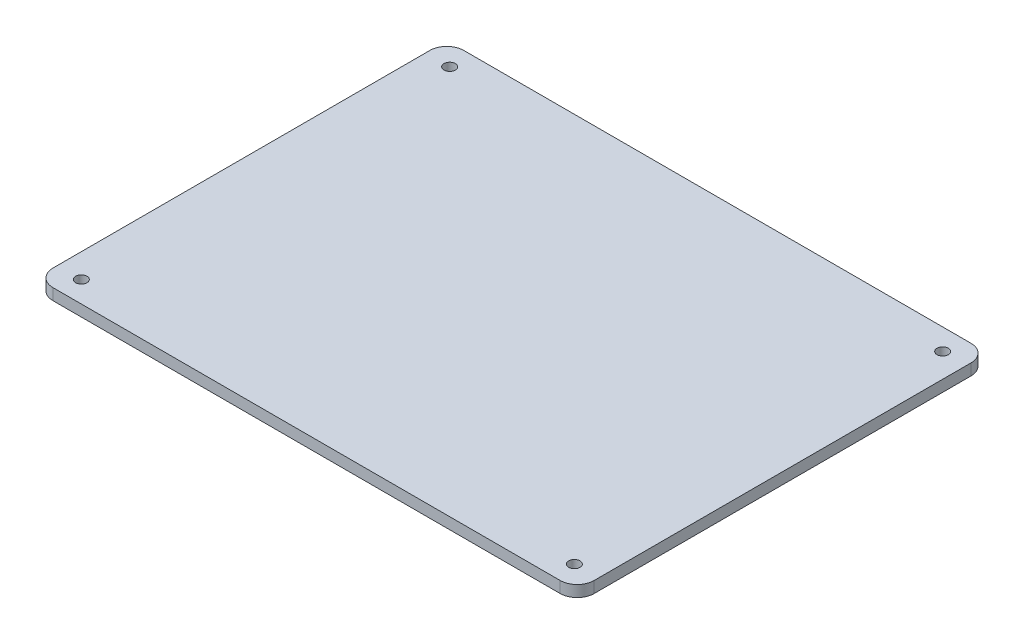
ISO-10303-21;
HEADER;
FILE_DESCRIPTION(('STEP AP214'),'2;1');
FILE_NAME('part.step','',(''),(''),'','','');
FILE_SCHEMA(('AUTOMOTIVE_DESIGN { 1 0 10303 214 1 1 1 1 }'));
ENDSEC;
DATA;
#1=APPLICATION_CONTEXT('core data for automotive mechanical design processes');
#2=APPLICATION_PROTOCOL_DEFINITION('international standard','automotive_design',2000,#1);
#3=PRODUCT_CONTEXT('',#1,'mechanical');
#4=PRODUCT('Part','Part','',(#3));
#5=PRODUCT_RELATED_PRODUCT_CATEGORY('part','',(#4));
#6=PRODUCT_DEFINITION_FORMATION('','',#4);
#7=PRODUCT_DEFINITION_CONTEXT('part definition',#1,'design');
#8=PRODUCT_DEFINITION('design','',#6,#7);
#9=PRODUCT_DEFINITION_SHAPE('','',#8);
#10=(LENGTH_UNIT() NAMED_UNIT(*) SI_UNIT(.MILLI.,.METRE.));
#11=(NAMED_UNIT(*) PLANE_ANGLE_UNIT() SI_UNIT($,.RADIAN.));
#12=(NAMED_UNIT(*) SI_UNIT($,.STERADIAN.) SOLID_ANGLE_UNIT());
#13=UNCERTAINTY_MEASURE_WITH_UNIT(LENGTH_MEASURE(1.E-05),#10,'distance_accuracy_value','');
#14=(GEOMETRIC_REPRESENTATION_CONTEXT(3) GLOBAL_UNCERTAINTY_ASSIGNED_CONTEXT((#13)) GLOBAL_UNIT_ASSIGNED_CONTEXT((#10,
#11,#12)) REPRESENTATION_CONTEXT('',''));
#15=CARTESIAN_POINT('',(0.,0.,0.));
#16=DIRECTION('',(0.,0.,1.));
#17=DIRECTION('',(1.,0.,0.));
#18=AXIS2_PLACEMENT_3D('',#15,#16,#17);
#19=CARTESIAN_POINT('',(-17.,-3.,-11.));
#20=DIRECTION('',(1.,0.,0.));
#21=DIRECTION('',(0.,0.,-1.));
#22=AXIS2_PLACEMENT_3D('',#19,#20,#21);
#23=PLANE('',#22);
#24=DIRECTION('',(0.,0.,-1.));
#25=VECTOR('',#24,1.);
#26=CARTESIAN_POINT('',(-17.,-1.5,-11.));
#27=LINE('',#26,#25);
#28=CARTESIAN_POINT('',(-17.,-1.5,10.9999999999999));
#29=VERTEX_POINT('',#28);
#30=CARTESIAN_POINT('',(-17.,-1.5,-11.));
#31=VERTEX_POINT('',#30);
#32=EDGE_CURVE('E513',#29,#31,#27,.T.);
#33=ORIENTED_EDGE('',*,*,#32,.T.);
#34=DIRECTION('',(0.,1.,0.));
#35=VECTOR('',#34,1.);
#36=CARTESIAN_POINT('',(-17.,-3.,-11.));
#37=LINE('',#36,#35);
#38=CARTESIAN_POINT('',(-17.,-3.,-11.));
#39=VERTEX_POINT('',#38);
#40=EDGE_CURVE('E177',#39,#31,#37,.T.);
#41=ORIENTED_EDGE('',*,*,#40,.F.);
#42=DIRECTION('',(0.,0.,-1.));
#43=VECTOR('',#42,1.);
#44=CARTESIAN_POINT('',(-17.,-3.,-11.));
#45=LINE('',#44,#43);
#46=CARTESIAN_POINT('',(-17.,-3.,10.9999999999999));
#47=VERTEX_POINT('',#46);
#48=EDGE_CURVE('E481',#47,#39,#45,.T.);
#49=ORIENTED_EDGE('',*,*,#48,.F.);
#50=DIRECTION('',(0.,1.,0.));
#51=VECTOR('',#50,1.);
#52=CARTESIAN_POINT('',(-17.,-3.,10.9999999999999));
#53=LINE('',#52,#51);
#54=EDGE_CURVE('E493',#47,#29,#53,.T.);
#55=ORIENTED_EDGE('',*,*,#54,.T.);
#56=EDGE_LOOP('',(#33,#41,#49,#55));
#57=FACE_BOUND('',#56,.T.);
#58=ADVANCED_FACE('F35',(#57),#23,.F.);
#59=CARTESIAN_POINT('',(16.9999999999998,-3.,-11.));
#60=DIRECTION('',(0.,0.,1.));
#61=DIRECTION('',(1.,0.,0.));
#62=AXIS2_PLACEMENT_3D('',#59,#60,#61);
#63=PLANE('',#62);
#64=DIRECTION('',(0.,1.,0.));
#65=VECTOR('',#64,1.);
#66=CARTESIAN_POINT('',(-15.,-1.5,-10.9999999999978));
#67=LINE('',#66,#65);
#68=CARTESIAN_POINT('',(-15.,-1.5,-10.9999999999978));
#69=VERTEX_POINT('',#68);
#70=CARTESIAN_POINT('',(-15.,0.,-10.9999999999978));
#71=VERTEX_POINT('',#70);
#72=EDGE_CURVE('E450',#69,#71,#67,.T.);
#73=ORIENTED_EDGE('',*,*,#72,.T.);
#74=DIRECTION('',(1.,0.,0.));
#75=VECTOR('',#74,1.);
#76=CARTESIAN_POINT('',(16.9999999999998,0.,-11.));
#77=LINE('',#76,#75);
#78=CARTESIAN_POINT('',(15.,0.,-11.));
#79=VERTEX_POINT('',#78);
#80=EDGE_CURVE('E454',#71,#79,#77,.T.);
#81=ORIENTED_EDGE('',*,*,#80,.T.);
#82=DIRECTION('',(0.,1.,0.));
#83=VECTOR('',#82,1.);
#84=CARTESIAN_POINT('',(15.,-1.5,-11.));
#85=LINE('',#84,#83);
#86=CARTESIAN_POINT('',(15.,-1.5,-11.));
#87=VERTEX_POINT('',#86);
#88=EDGE_CURVE('E478',#87,#79,#85,.T.);
#89=ORIENTED_EDGE('',*,*,#88,.F.);
#90=DIRECTION('',(1.,0.,0.));
#91=VECTOR('',#90,1.);
#92=CARTESIAN_POINT('',(16.9999999999998,-1.5,-11.));
#93=LINE('',#92,#91);
#94=CARTESIAN_POINT('',(16.9999999999998,-1.5,-11.));
#95=VERTEX_POINT('',#94);
#96=EDGE_CURVE('E464',#87,#95,#93,.T.);
#97=ORIENTED_EDGE('',*,*,#96,.T.);
#98=DIRECTION('',(0.,1.,0.));
#99=VECTOR('',#98,1.);
#100=CARTESIAN_POINT('',(16.9999999999998,-3.,-11.));
#101=LINE('',#100,#99);
#102=CARTESIAN_POINT('',(16.9999999999998,-3.,-11.));
#103=VERTEX_POINT('',#102);
#104=EDGE_CURVE('E501',#103,#95,#101,.T.);
#105=ORIENTED_EDGE('',*,*,#104,.F.);
#106=DIRECTION('',(1.,0.,0.));
#107=VECTOR('',#106,1.);
#108=CARTESIAN_POINT('',(16.9999999999998,-3.,-11.));
#109=LINE('',#108,#107);
#110=EDGE_CURVE('E484',#39,#103,#109,.T.);
#111=ORIENTED_EDGE('',*,*,#110,.F.);
#112=ORIENTED_EDGE('',*,*,#40,.T.);
#113=DIRECTION('',(1.,0.,1.08160008727154E-12));
#114=VECTOR('',#113,1.);
#115=CARTESIAN_POINT('',(-15.,-1.5,-10.9999999999978));
#116=LINE('',#115,#114);
#117=EDGE_CURVE('E456',#31,#69,#116,.T.);
#118=ORIENTED_EDGE('',*,*,#117,.T.);
#119=EDGE_LOOP('',(#73,#81,#89,#97,#105,#111,#112,#118));
#120=FACE_BOUND('',#119,.T.);
#121=ADVANCED_FACE('F232',(#120),#63,.F.);
#122=CARTESIAN_POINT('',(16.9999999999998,-3.,11.));
#123=DIRECTION('',(-1.,0.,0.));
#124=DIRECTION('',(0.,0.,1.));
#125=AXIS2_PLACEMENT_3D('',#122,#123,#124);
#126=PLANE('',#125);
#127=DIRECTION('',(0.,0.,1.));
#128=VECTOR('',#127,1.);
#129=CARTESIAN_POINT('',(16.9999999999998,-1.5,11.));
#130=LINE('',#129,#128);
#131=CARTESIAN_POINT('',(16.9999999999998,-1.5,11.));
#132=VERTEX_POINT('',#131);
#133=EDGE_CURVE('E468',#95,#132,#130,.T.);
#134=ORIENTED_EDGE('',*,*,#133,.T.);
#135=DIRECTION('',(0.,1.,0.));
#136=VECTOR('',#135,1.);
#137=CARTESIAN_POINT('',(16.9999999999998,-3.,11.));
#138=LINE('',#137,#136);
#139=CARTESIAN_POINT('',(16.9999999999998,-3.,11.));
#140=VERTEX_POINT('',#139);
#141=EDGE_CURVE('E498',#140,#132,#138,.T.);
#142=ORIENTED_EDGE('',*,*,#141,.F.);
#143=DIRECTION('',(0.,0.,1.));
#144=VECTOR('',#143,1.);
#145=CARTESIAN_POINT('',(16.9999999999998,-3.,11.));
#146=LINE('',#145,#144);
#147=EDGE_CURVE('E487',#103,#140,#146,.T.);
#148=ORIENTED_EDGE('',*,*,#147,.F.);
#149=ORIENTED_EDGE('',*,*,#104,.T.);
#150=EDGE_LOOP('',(#134,#142,#148,#149));
#151=FACE_BOUND('',#150,.T.);
#152=ADVANCED_FACE('F238',(#151),#126,.F.);
#153=CARTESIAN_POINT('',(-17.,-3.,10.9999999999999));
#154=DIRECTION('',(0.,0.,-1.));
#155=DIRECTION('',(-1.,0.,0.));
#156=AXIS2_PLACEMENT_3D('',#153,#154,#155);
#157=PLANE('',#156);
#158=DIRECTION('',(0.,1.,0.));
#159=VECTOR('',#158,1.);
#160=CARTESIAN_POINT('',(-15.,-1.5,11.));
#161=LINE('',#160,#159);
#162=CARTESIAN_POINT('',(-15.,-1.5,11.));
#163=VERTEX_POINT('',#162);
#164=CARTESIAN_POINT('',(-15.,0.,10.9999999999999));
#165=VERTEX_POINT('',#164);
#166=EDGE_CURVE('E52',#163,#165,#161,.T.);
#167=ORIENTED_EDGE('',*,*,#166,.F.);
#168=DIRECTION('',(-1.,0.,0.));
#169=VECTOR('',#168,1.);
#170=CARTESIAN_POINT('',(-17.,-1.5,10.9999999999999));
#171=LINE('',#170,#169);
#172=EDGE_CURVE('E442',#163,#29,#171,.T.);
#173=ORIENTED_EDGE('',*,*,#172,.T.);
#174=ORIENTED_EDGE('',*,*,#54,.F.);
#175=DIRECTION('',(-1.,0.,0.));
#176=VECTOR('',#175,1.);
#177=CARTESIAN_POINT('',(-17.,-3.,10.9999999999999));
#178=LINE('',#177,#176);
#179=EDGE_CURVE('E490',#140,#47,#178,.T.);
#180=ORIENTED_EDGE('',*,*,#179,.F.);
#181=ORIENTED_EDGE('',*,*,#141,.T.);
#182=DIRECTION('',(-1.,0.,-1.0798653637957E-12));
#183=VECTOR('',#182,1.);
#184=CARTESIAN_POINT('',(15.,-1.5,10.9999999999978));
#185=LINE('',#184,#183);
#186=CARTESIAN_POINT('',(15.,-1.5,10.9999999999978));
#187=VERTEX_POINT('',#186);
#188=EDGE_CURVE('E471',#132,#187,#185,.T.);
#189=ORIENTED_EDGE('',*,*,#188,.T.);
#190=DIRECTION('',(0.,1.,0.));
#191=VECTOR('',#190,1.);
#192=CARTESIAN_POINT('',(15.,-1.5,10.9999999999978));
#193=LINE('',#192,#191);
#194=CARTESIAN_POINT('',(15.,0.,10.9999999999978));
#195=VERTEX_POINT('',#194);
#196=EDGE_CURVE('E474',#187,#195,#193,.T.);
#197=ORIENTED_EDGE('',*,*,#196,.T.);
#198=DIRECTION('',(-1.,0.,0.));
#199=VECTOR('',#198,1.);
#200=CARTESIAN_POINT('',(-17.,0.,10.9999999999999));
#201=LINE('',#200,#199);
#202=EDGE_CURVE('E446',#195,#165,#201,.T.);
#203=ORIENTED_EDGE('',*,*,#202,.T.);
#204=EDGE_LOOP('',(#167,#173,#174,#180,#181,#189,#197,#203));
#205=FACE_BOUND('',#204,.T.);
#206=ADVANCED_FACE('F266',(#205),#157,.F.);
#207=CARTESIAN_POINT('',(-44.74999999995,0.,-33.2499999999999));
#208=DIRECTION('',(0.,1.,0.));
#209=DIRECTION('',(0.,0.,1.));
#210=AXIS2_PLACEMENT_3D('',#207,#208,#209);
#211=PLANE('',#210);
#212=ORIENTED_EDGE('',*,*,#80,.F.);
#213=DIRECTION('',(0.,0.,1.));
#214=VECTOR('',#213,1.);
#215=CARTESIAN_POINT('',(-15.,0.,11.));
#216=LINE('',#215,#214);
#217=EDGE_CURVE('E459',#71,#165,#216,.T.);
#218=ORIENTED_EDGE('',*,*,#217,.T.);
#219=ORIENTED_EDGE('',*,*,#202,.F.);
#220=DIRECTION('',(0.,0.,-1.));
#221=VECTOR('',#220,1.);
#222=CARTESIAN_POINT('',(15.,0.,-11.));
#223=LINE('',#222,#221);
#224=EDGE_CURVE('E465',#195,#79,#223,.T.);
#225=ORIENTED_EDGE('',*,*,#224,.T.);
#226=EDGE_LOOP('',(#212,#218,#219,#225));
#227=FACE_BOUND('',#226,.T.);
#228=CARTESIAN_POINT('',(-44.74999999995,0.,-33.2499999999999));
#229=DIRECTION('',(0.,1.,0.));
#230=DIRECTION('',(0.,0.,1.));
#231=AXIS2_PLACEMENT_3D('',#228,#229,#230);
#232=CIRCLE('',#231,3.);
#233=CARTESIAN_POINT('',(-44.7499999999499,0.,-36.2499999999999));
#234=VERTEX_POINT('',#233);
#235=CARTESIAN_POINT('',(-47.74999999995,0.,-33.2499999999999));
#236=VERTEX_POINT('',#235);
#237=EDGE_CURVE('E145',#234,#236,#232,.T.);
#238=ORIENTED_EDGE('',*,*,#237,.F.);
#239=DIRECTION('',(-1.,0.,0.));
#240=VECTOR('',#239,1.);
#241=CARTESIAN_POINT('',(-44.7499999999499,0.,-36.2499999999999));
#242=LINE('',#241,#240);
#243=CARTESIAN_POINT('',(44.7500000000524,0.,-36.2499999999978));
#244=VERTEX_POINT('',#243);
#245=EDGE_CURVE('E94',#244,#234,#242,.T.);
#246=ORIENTED_EDGE('',*,*,#245,.F.);
#247=CARTESIAN_POINT('',(44.7500000000524,0.,-33.2499999999978));
#248=DIRECTION('',(0.,1.,0.));
#249=DIRECTION('',(0.,0.,1.));
#250=AXIS2_PLACEMENT_3D('',#247,#248,#249);
#251=CIRCLE('',#250,3.);
#252=CARTESIAN_POINT('',(47.7500000000524,0.,-33.2499999999978));
#253=VERTEX_POINT('',#252);
#254=EDGE_CURVE('E158',#253,#244,#251,.T.);
#255=ORIENTED_EDGE('',*,*,#254,.F.);
#256=DIRECTION('',(0.,0.,-1.));
#257=VECTOR('',#256,1.);
#258=CARTESIAN_POINT('',(47.7500000000523,0.,33.2499999999691));
#259=LINE('',#258,#257);
#260=CARTESIAN_POINT('',(47.7500000000523,0.,33.2499999999691));
#261=VERTEX_POINT('',#260);
#262=EDGE_CURVE('E133',#261,#253,#259,.T.);
#263=ORIENTED_EDGE('',*,*,#262,.F.);
#264=CARTESIAN_POINT('',(44.7500000000523,0.,33.2499999999691));
#265=DIRECTION('',(0.,1.,0.));
#266=DIRECTION('',(0.,0.,1.));
#267=AXIS2_PLACEMENT_3D('',#264,#265,#266);
#268=CIRCLE('',#267,3.);
#269=CARTESIAN_POINT('',(44.7500000000533,0.,36.2499999999691));
#270=VERTEX_POINT('',#269);
#271=EDGE_CURVE('E155',#270,#261,#268,.T.);
#272=ORIENTED_EDGE('',*,*,#271,.F.);
#273=DIRECTION('',(1.,0.,-3.09497926976505E-13));
#274=VECTOR('',#273,1.);
#275=CARTESIAN_POINT('',(-44.7499999999483,0.,36.2499999999968));
#276=LINE('',#275,#274);
#277=CARTESIAN_POINT('',(-44.7499999999483,0.,36.2499999999968));
#278=VERTEX_POINT('',#277);
#279=EDGE_CURVE('E153',#278,#270,#276,.T.);
#280=ORIENTED_EDGE('',*,*,#279,.F.);
#281=CARTESIAN_POINT('',(-44.7499999999493,0.,33.2499999999968));
#282=DIRECTION('',(0.,1.,0.));
#283=DIRECTION('',(0.,0.,-1.));
#284=AXIS2_PLACEMENT_3D('',#281,#282,#283);
#285=CIRCLE('',#284,3.);
#286=CARTESIAN_POINT('',(-47.7499999999493,0.,33.2499999999968));
#287=VERTEX_POINT('',#286);
#288=EDGE_CURVE('E151',#287,#278,#285,.T.);
#289=ORIENTED_EDGE('',*,*,#288,.F.);
#290=DIRECTION('',(0.,0.,1.));
#291=VECTOR('',#290,1.);
#292=CARTESIAN_POINT('',(-47.7499999999493,0.,33.2499999999968));
#293=LINE('',#292,#291);
#294=EDGE_CURVE('E148',#236,#287,#293,.T.);
#295=ORIENTED_EDGE('',*,*,#294,.F.);
#296=EDGE_LOOP('',(#238,#246,#255,#263,#272,#280,#289,#295));
#297=FACE_BOUND('',#296,.T.);
#298=CARTESIAN_POINT('',(-43.4999999999955,0.,-32.4999999999994));
#299=DIRECTION('',(0.,1.,0.));
#300=DIRECTION('',(0.,0.,1.));
#301=AXIS2_PLACEMENT_3D('',#298,#299,#300);
#302=CIRCLE('',#301,0.999999999999998);
#303=CARTESIAN_POINT('',(-43.4999999999955,0.,-31.4999999999994));
#304=VERTEX_POINT('',#303);
#305=EDGE_CURVE('E173',#304,#304,#302,.F.);
#306=ORIENTED_EDGE('',*,*,#305,.F.);
#307=EDGE_LOOP('',(#306));
#308=FACE_BOUND('',#307,.T.);
#309=CARTESIAN_POINT('',(-43.4999999999955,0.,32.4999999999994));
#310=DIRECTION('',(0.,1.,0.));
#311=DIRECTION('',(0.,0.,1.));
#312=AXIS2_PLACEMENT_3D('',#309,#310,#311);
#313=CIRCLE('',#312,0.999999999999998);
#314=CARTESIAN_POINT('',(-43.4999999999955,0.,33.4999999999994));
#315=VERTEX_POINT('',#314);
#316=EDGE_CURVE('E178',#315,#315,#313,.F.);
#317=ORIENTED_EDGE('',*,*,#316,.F.);
#318=EDGE_LOOP('',(#317));
#319=FACE_BOUND('',#318,.T.);
#320=CARTESIAN_POINT('',(43.499999999999,0.,32.4999999999994));
#321=DIRECTION('',(0.,1.,0.));
#322=DIRECTION('',(0.,0.,1.));
#323=AXIS2_PLACEMENT_3D('',#320,#321,#322);
#324=CIRCLE('',#323,0.999999999999998);
#325=CARTESIAN_POINT('',(43.499999999999,0.,33.4999999999994));
#326=VERTEX_POINT('',#325);
#327=EDGE_CURVE('E181',#326,#326,#324,.F.);
#328=ORIENTED_EDGE('',*,*,#327,.F.);
#329=EDGE_LOOP('',(#328));
#330=FACE_BOUND('',#329,.T.);
#331=CARTESIAN_POINT('',(43.499999999999,0.,-32.4999999999994));
#332=DIRECTION('',(0.,1.,0.));
#333=DIRECTION('',(0.,0.,1.));
#334=AXIS2_PLACEMENT_3D('',#331,#332,#333);
#335=CIRCLE('',#334,0.999999999999998);
#336=CARTESIAN_POINT('',(43.499999999999,0.,-31.4999999999994));
#337=VERTEX_POINT('',#336);
#338=EDGE_CURVE('E39',#337,#337,#335,.F.);
#339=ORIENTED_EDGE('',*,*,#338,.F.);
#340=EDGE_LOOP('',(#339));
#341=FACE_BOUND('',#340,.T.);
#342=ADVANCED_FACE('F214',(#227,#297,#308,#319,#330,#341),#211,.F.);
#343=CARTESIAN_POINT('',(-44.74999999995,2.,-33.2499999999999));
#344=DIRECTION('',(0.,-1.,0.));
#345=DIRECTION('',(0.,0.,-1.));
#346=AXIS2_PLACEMENT_3D('',#343,#344,#345);
#347=CYLINDRICAL_SURFACE('',#346,3.);
#348=ORIENTED_EDGE('',*,*,#237,.T.);
#349=DIRECTION('',(0.,-1.,0.));
#350=VECTOR('',#349,1.);
#351=CARTESIAN_POINT('',(-47.74999999995,2.,-33.2499999999999));
#352=LINE('',#351,#350);
#353=CARTESIAN_POINT('',(-47.74999999995,2.,-33.2499999999999));
#354=VERTEX_POINT('',#353);
#355=EDGE_CURVE('E11',#354,#236,#352,.T.);
#356=ORIENTED_EDGE('',*,*,#355,.F.);
#357=CARTESIAN_POINT('',(-44.74999999995,2.,-33.2499999999999));
#358=DIRECTION('',(0.,1.,0.));
#359=DIRECTION('',(0.,0.,1.));
#360=AXIS2_PLACEMENT_3D('',#357,#358,#359);
#361=CIRCLE('',#360,3.);
#362=CARTESIAN_POINT('',(-44.7499999999499,2.,-36.2499999999999));
#363=VERTEX_POINT('',#362);
#364=EDGE_CURVE('E161',#363,#354,#361,.T.);
#365=ORIENTED_EDGE('',*,*,#364,.F.);
#366=DIRECTION('',(0.,-1.,0.));
#367=VECTOR('',#366,1.);
#368=CARTESIAN_POINT('',(-44.7499999999499,2.,-36.2499999999999));
#369=LINE('',#368,#367);
#370=EDGE_CURVE('E141',#363,#234,#369,.T.);
#371=ORIENTED_EDGE('',*,*,#370,.T.);
#372=EDGE_LOOP('',(#348,#356,#365,#371));
#373=FACE_BOUND('',#372,.T.);
#374=ADVANCED_FACE('F37',(#373),#347,.T.);
#375=CARTESIAN_POINT('',(-47.7499999999493,2.,33.2499999999968));
#376=DIRECTION('',(1.,0.,0.));
#377=DIRECTION('',(0.,0.,-1.));
#378=AXIS2_PLACEMENT_3D('',#375,#376,#377);
#379=PLANE('',#378);
#380=ORIENTED_EDGE('',*,*,#294,.T.);
#381=DIRECTION('',(0.,-1.,0.));
#382=VECTOR('',#381,1.);
#383=CARTESIAN_POINT('',(-47.7499999999493,2.,33.2499999999968));
#384=LINE('',#383,#382);
#385=CARTESIAN_POINT('',(-47.7499999999493,2.,33.2499999999968));
#386=VERTEX_POINT('',#385);
#387=EDGE_CURVE('E44',#386,#287,#384,.T.);
#388=ORIENTED_EDGE('',*,*,#387,.F.);
#389=DIRECTION('',(0.,0.,1.));
#390=VECTOR('',#389,1.);
#391=CARTESIAN_POINT('',(-47.7499999999493,2.,33.2499999999968));
#392=LINE('',#391,#390);
#393=EDGE_CURVE('E102',#354,#386,#392,.T.);
#394=ORIENTED_EDGE('',*,*,#393,.F.);
#395=ORIENTED_EDGE('',*,*,#355,.T.);
#396=EDGE_LOOP('',(#380,#388,#394,#395));
#397=FACE_BOUND('',#396,.T.);
#398=ADVANCED_FACE('F220',(#397),#379,.F.);
#399=CARTESIAN_POINT('',(-44.7499999999493,2.,33.2499999999968));
#400=DIRECTION('',(0.,-1.,0.));
#401=DIRECTION('',(0.,0.,-1.));
#402=AXIS2_PLACEMENT_3D('',#399,#400,#401);
#403=CYLINDRICAL_SURFACE('',#402,3.);
#404=ORIENTED_EDGE('',*,*,#288,.T.);
#405=DIRECTION('',(0.,-1.,0.));
#406=VECTOR('',#405,1.);
#407=CARTESIAN_POINT('',(-44.7499999999483,2.,36.2499999999968));
#408=LINE('',#407,#406);
#409=CARTESIAN_POINT('',(-44.7499999999483,2.,36.2499999999968));
#410=VERTEX_POINT('',#409);
#411=EDGE_CURVE('E168',#410,#278,#408,.T.);
#412=ORIENTED_EDGE('',*,*,#411,.F.);
#413=CARTESIAN_POINT('',(-44.7499999999493,2.,33.2499999999968));
#414=DIRECTION('',(0.,1.,0.));
#415=DIRECTION('',(0.,0.,-1.));
#416=AXIS2_PLACEMENT_3D('',#413,#414,#415);
#417=CIRCLE('',#416,3.);
#418=EDGE_CURVE('E199',#386,#410,#417,.T.);
#419=ORIENTED_EDGE('',*,*,#418,.F.);
#420=ORIENTED_EDGE('',*,*,#387,.T.);
#421=EDGE_LOOP('',(#404,#412,#419,#420));
#422=FACE_BOUND('',#421,.T.);
#423=ADVANCED_FACE('F223',(#422),#403,.T.);
#424=CARTESIAN_POINT('',(-44.7499999999483,2.,36.2499999999968));
#425=DIRECTION('',(-3.09497926976505E-13,0.,-1.));
#426=DIRECTION('',(-1.,0.,3.09497926976505E-13));
#427=AXIS2_PLACEMENT_3D('',#424,#425,#426);
#428=PLANE('',#427);
#429=ORIENTED_EDGE('',*,*,#279,.T.);
#430=DIRECTION('',(0.,-1.,0.));
#431=VECTOR('',#430,1.);
#432=CARTESIAN_POINT('',(44.7500000000533,2.,36.2499999999691));
#433=LINE('',#432,#431);
#434=CARTESIAN_POINT('',(44.7500000000533,2.,36.2499999999691));
#435=VERTEX_POINT('',#434);
#436=EDGE_CURVE('E165',#435,#270,#433,.T.);
#437=ORIENTED_EDGE('',*,*,#436,.F.);
#438=DIRECTION('',(1.,0.,-3.09497926976505E-13));
#439=VECTOR('',#438,1.);
#440=CARTESIAN_POINT('',(-44.7499999999483,2.,36.2499999999968));
#441=LINE('',#440,#439);
#442=EDGE_CURVE('E201',#410,#435,#441,.T.);
#443=ORIENTED_EDGE('',*,*,#442,.F.);
#444=ORIENTED_EDGE('',*,*,#411,.T.);
#445=EDGE_LOOP('',(#429,#437,#443,#444));
#446=FACE_BOUND('',#445,.T.);
#447=ADVANCED_FACE('F207',(#446),#428,.F.);
#448=CARTESIAN_POINT('',(44.7500000000523,2.,33.2499999999691));
#449=DIRECTION('',(0.,-1.,0.));
#450=DIRECTION('',(0.,0.,-1.));
#451=AXIS2_PLACEMENT_3D('',#448,#449,#450);
#452=CYLINDRICAL_SURFACE('',#451,3.);
#453=ORIENTED_EDGE('',*,*,#271,.T.);
#454=DIRECTION('',(0.,-1.,0.));
#455=VECTOR('',#454,1.);
#456=CARTESIAN_POINT('',(47.7500000000523,2.,33.2499999999691));
#457=LINE('',#456,#455);
#458=CARTESIAN_POINT('',(47.7500000000523,2.,33.2499999999691));
#459=VERTEX_POINT('',#458);
#460=EDGE_CURVE('E136',#459,#261,#457,.T.);
#461=ORIENTED_EDGE('',*,*,#460,.F.);
#462=CARTESIAN_POINT('',(44.7500000000523,2.,33.2499999999691));
#463=DIRECTION('',(0.,1.,0.));
#464=DIRECTION('',(0.,0.,1.));
#465=AXIS2_PLACEMENT_3D('',#462,#463,#464);
#466=CIRCLE('',#465,3.);
#467=EDGE_CURVE('E124',#435,#459,#466,.T.);
#468=ORIENTED_EDGE('',*,*,#467,.F.);
#469=ORIENTED_EDGE('',*,*,#436,.T.);
#470=EDGE_LOOP('',(#453,#461,#468,#469));
#471=FACE_BOUND('',#470,.T.);
#472=ADVANCED_FACE('F211',(#471),#452,.T.);
#473=CARTESIAN_POINT('',(47.7500000000523,2.,33.2499999999691));
#474=DIRECTION('',(-1.,0.,0.));
#475=DIRECTION('',(0.,0.,1.));
#476=AXIS2_PLACEMENT_3D('',#473,#474,#475);
#477=PLANE('',#476);
#478=ORIENTED_EDGE('',*,*,#262,.T.);
#479=DIRECTION('',(0.,-1.,0.));
#480=VECTOR('',#479,1.);
#481=CARTESIAN_POINT('',(47.7500000000524,2.,-33.2499999999978));
#482=LINE('',#481,#480);
#483=CARTESIAN_POINT('',(47.7500000000524,2.,-33.2499999999978));
#484=VERTEX_POINT('',#483);
#485=EDGE_CURVE('E130',#484,#253,#482,.T.);
#486=ORIENTED_EDGE('',*,*,#485,.F.);
#487=DIRECTION('',(0.,0.,-1.));
#488=VECTOR('',#487,1.);
#489=CARTESIAN_POINT('',(47.7500000000523,2.,33.2499999999691));
#490=LINE('',#489,#488);
#491=EDGE_CURVE('E117',#459,#484,#490,.T.);
#492=ORIENTED_EDGE('',*,*,#491,.F.);
#493=ORIENTED_EDGE('',*,*,#460,.T.);
#494=EDGE_LOOP('',(#478,#486,#492,#493));
#495=FACE_BOUND('',#494,.T.);
#496=ADVANCED_FACE('F131',(#495),#477,.F.);
#497=CARTESIAN_POINT('',(44.7500000000524,2.,-33.2499999999978));
#498=DIRECTION('',(0.,-1.,0.));
#499=DIRECTION('',(0.,0.,-1.));
#500=AXIS2_PLACEMENT_3D('',#497,#498,#499);
#501=CYLINDRICAL_SURFACE('',#500,3.);
#502=ORIENTED_EDGE('',*,*,#254,.T.);
#503=DIRECTION('',(0.,-1.,0.));
#504=VECTOR('',#503,1.);
#505=CARTESIAN_POINT('',(44.7500000000524,2.,-36.2499999999978));
#506=LINE('',#505,#504);
#507=CARTESIAN_POINT('',(44.7500000000524,2.,-36.2499999999978));
#508=VERTEX_POINT('',#507);
#509=EDGE_CURVE('E137',#508,#244,#506,.T.);
#510=ORIENTED_EDGE('',*,*,#509,.F.);
#511=CARTESIAN_POINT('',(44.7500000000524,2.,-33.2499999999978));
#512=DIRECTION('',(0.,1.,0.));
#513=DIRECTION('',(0.,0.,1.));
#514=AXIS2_PLACEMENT_3D('',#511,#512,#513);
#515=CIRCLE('',#514,3.);
#516=EDGE_CURVE('E121',#484,#508,#515,.T.);
#517=ORIENTED_EDGE('',*,*,#516,.F.);
#518=ORIENTED_EDGE('',*,*,#485,.T.);
#519=EDGE_LOOP('',(#502,#510,#517,#518));
#520=FACE_BOUND('',#519,.T.);
#521=ADVANCED_FACE('F139',(#520),#501,.T.);
#522=CARTESIAN_POINT('',(-44.7499999999499,2.,-36.2499999999999));
#523=DIRECTION('',(0.,0.,1.));
#524=DIRECTION('',(1.,0.,0.));
#525=AXIS2_PLACEMENT_3D('',#522,#523,#524);
#526=PLANE('',#525);
#527=ORIENTED_EDGE('',*,*,#245,.T.);
#528=ORIENTED_EDGE('',*,*,#370,.F.);
#529=DIRECTION('',(-1.,0.,0.));
#530=VECTOR('',#529,1.);
#531=CARTESIAN_POINT('',(-44.7499999999499,2.,-36.2499999999999));
#532=LINE('',#531,#530);
#533=EDGE_CURVE('E61',#508,#363,#532,.T.);
#534=ORIENTED_EDGE('',*,*,#533,.F.);
#535=ORIENTED_EDGE('',*,*,#509,.T.);
#536=EDGE_LOOP('',(#527,#528,#534,#535));
#537=FACE_BOUND('',#536,.T.);
#538=ADVANCED_FACE('F216',(#537),#526,.F.);
#539=CARTESIAN_POINT('',(-44.74999999995,2.,-33.2499999999999));
#540=DIRECTION('',(0.,1.,0.));
#541=DIRECTION('',(0.,0.,1.));
#542=AXIS2_PLACEMENT_3D('',#539,#540,#541);
#543=PLANE('',#542);
#544=CARTESIAN_POINT('',(43.499999999999,2.,-32.4999999999994));
#545=DIRECTION('',(0.,1.,0.));
#546=DIRECTION('',(0.,0.,1.));
#547=AXIS2_PLACEMENT_3D('',#544,#545,#546);
#548=CIRCLE('',#547,0.999999999999998);
#549=CARTESIAN_POINT('',(43.499999999999,2.,-31.4999999999994));
#550=VERTEX_POINT('',#549);
#551=EDGE_CURVE('E149',#550,#550,#548,.F.);
#552=ORIENTED_EDGE('',*,*,#551,.T.);
#553=EDGE_LOOP('',(#552));
#554=FACE_BOUND('',#553,.T.);
#555=CARTESIAN_POINT('',(43.499999999999,2.,32.4999999999994));
#556=DIRECTION('',(0.,1.,0.));
#557=DIRECTION('',(0.,0.,1.));
#558=AXIS2_PLACEMENT_3D('',#555,#556,#557);
#559=CIRCLE('',#558,0.999999999999998);
#560=CARTESIAN_POINT('',(43.499999999999,2.,33.4999999999994));
#561=VERTEX_POINT('',#560);
#562=EDGE_CURVE('E183',#561,#561,#559,.F.);
#563=ORIENTED_EDGE('',*,*,#562,.T.);
#564=EDGE_LOOP('',(#563));
#565=FACE_BOUND('',#564,.T.);
#566=CARTESIAN_POINT('',(-43.4999999999955,2.,32.4999999999994));
#567=DIRECTION('',(0.,1.,0.));
#568=DIRECTION('',(0.,0.,1.));
#569=AXIS2_PLACEMENT_3D('',#566,#567,#568);
#570=CIRCLE('',#569,0.999999999999998);
#571=CARTESIAN_POINT('',(-43.4999999999955,2.,33.4999999999994));
#572=VERTEX_POINT('',#571);
#573=EDGE_CURVE('E180',#572,#572,#570,.F.);
#574=ORIENTED_EDGE('',*,*,#573,.T.);
#575=EDGE_LOOP('',(#574));
#576=FACE_BOUND('',#575,.T.);
#577=CARTESIAN_POINT('',(-43.4999999999955,2.,-32.4999999999994));
#578=DIRECTION('',(0.,1.,0.));
#579=DIRECTION('',(0.,0.,1.));
#580=AXIS2_PLACEMENT_3D('',#577,#578,#579);
#581=CIRCLE('',#580,0.999999999999998);
#582=CARTESIAN_POINT('',(-43.4999999999955,2.,-31.4999999999994));
#583=VERTEX_POINT('',#582);
#584=EDGE_CURVE('E176',#583,#583,#581,.F.);
#585=ORIENTED_EDGE('',*,*,#584,.T.);
#586=EDGE_LOOP('',(#585));
#587=FACE_BOUND('',#586,.T.);
#588=ORIENTED_EDGE('',*,*,#364,.T.);
#589=ORIENTED_EDGE('',*,*,#393,.T.);
#590=ORIENTED_EDGE('',*,*,#418,.T.);
#591=ORIENTED_EDGE('',*,*,#442,.T.);
#592=ORIENTED_EDGE('',*,*,#467,.T.);
#593=ORIENTED_EDGE('',*,*,#491,.T.);
#594=ORIENTED_EDGE('',*,*,#516,.T.);
#595=ORIENTED_EDGE('',*,*,#533,.T.);
#596=EDGE_LOOP('',(#588,#589,#590,#591,#592,#593,#594,#595));
#597=FACE_BOUND('',#596,.T.);
#598=ADVANCED_FACE('F119',(#554,#565,#576,#587,#597),#543,.T.);
#599=CARTESIAN_POINT('',(-43.4999999999955,8.,-32.4999999999994));
#600=DIRECTION('',(0.,-1.,0.));
#601=DIRECTION('',(0.,0.,-1.));
#602=AXIS2_PLACEMENT_3D('',#599,#600,#601);
#603=CYLINDRICAL_SURFACE('',#602,0.999999999999998);
#604=ORIENTED_EDGE('',*,*,#584,.F.);
#605=EDGE_LOOP('',(#604));
#606=FACE_BOUND('',#605,.T.);
#607=ORIENTED_EDGE('',*,*,#305,.T.);
#608=EDGE_LOOP('',(#607));
#609=FACE_BOUND('',#608,.T.);
#610=ADVANCED_FACE('F248',(#606,#609),#603,.F.);
#611=CARTESIAN_POINT('',(-43.4999999999955,8.,32.4999999999994));
#612=DIRECTION('',(0.,-1.,0.));
#613=DIRECTION('',(0.,0.,-1.));
#614=AXIS2_PLACEMENT_3D('',#611,#612,#613);
#615=CYLINDRICAL_SURFACE('',#614,0.999999999999998);
#616=ORIENTED_EDGE('',*,*,#573,.F.);
#617=EDGE_LOOP('',(#616));
#618=FACE_BOUND('',#617,.T.);
#619=ORIENTED_EDGE('',*,*,#316,.T.);
#620=EDGE_LOOP('',(#619));
#621=FACE_BOUND('',#620,.T.);
#622=ADVANCED_FACE('F244',(#618,#621),#615,.F.);
#623=CARTESIAN_POINT('',(43.499999999999,8.,32.4999999999994));
#624=DIRECTION('',(0.,-1.,0.));
#625=DIRECTION('',(0.,0.,-1.));
#626=AXIS2_PLACEMENT_3D('',#623,#624,#625);
#627=CYLINDRICAL_SURFACE('',#626,0.999999999999998);
#628=ORIENTED_EDGE('',*,*,#562,.F.);
#629=EDGE_LOOP('',(#628));
#630=FACE_BOUND('',#629,.T.);
#631=ORIENTED_EDGE('',*,*,#327,.T.);
#632=EDGE_LOOP('',(#631));
#633=FACE_BOUND('',#632,.T.);
#634=ADVANCED_FACE('F247',(#630,#633),#627,.F.);
#635=CARTESIAN_POINT('',(43.499999999999,8.,-32.4999999999994));
#636=DIRECTION('',(0.,-1.,0.));
#637=DIRECTION('',(0.,0.,-1.));
#638=AXIS2_PLACEMENT_3D('',#635,#636,#637);
#639=CYLINDRICAL_SURFACE('',#638,0.999999999999998);
#640=ORIENTED_EDGE('',*,*,#551,.F.);
#641=EDGE_LOOP('',(#640));
#642=FACE_BOUND('',#641,.T.);
#643=ORIENTED_EDGE('',*,*,#338,.T.);
#644=EDGE_LOOP('',(#643));
#645=FACE_BOUND('',#644,.T.);
#646=ADVANCED_FACE('F252',(#642,#645),#639,.F.);
#647=CARTESIAN_POINT('',(0.,-3.,0.));
#648=DIRECTION('',(0.,1.,0.));
#649=DIRECTION('',(0.,0.,1.));
#650=AXIS2_PLACEMENT_3D('',#647,#648,#649);
#651=PLANE('',#650);
#652=ORIENTED_EDGE('',*,*,#48,.T.);
#653=ORIENTED_EDGE('',*,*,#110,.T.);
#654=ORIENTED_EDGE('',*,*,#147,.T.);
#655=ORIENTED_EDGE('',*,*,#179,.T.);
#656=EDGE_LOOP('',(#652,#653,#654,#655));
#657=FACE_BOUND('',#656,.T.);
#658=ADVANCED_FACE('F256',(#657),#651,.F.);
#659=CARTESIAN_POINT('',(15.,-1.5,-11.));
#660=DIRECTION('',(1.,0.,0.));
#661=DIRECTION('',(0.,0.,-1.));
#662=AXIS2_PLACEMENT_3D('',#659,#660,#661);
#663=PLANE('',#662);
#664=ORIENTED_EDGE('',*,*,#224,.F.);
#665=ORIENTED_EDGE('',*,*,#196,.F.);
#666=DIRECTION('',(0.,0.,-1.));
#667=VECTOR('',#666,1.);
#668=CARTESIAN_POINT('',(15.,-1.5,-11.));
#669=LINE('',#668,#667);
#670=EDGE_CURVE('E461',#187,#87,#669,.T.);
#671=ORIENTED_EDGE('',*,*,#670,.T.);
#672=ORIENTED_EDGE('',*,*,#88,.T.);
#673=EDGE_LOOP('',(#664,#665,#671,#672));
#674=FACE_BOUND('',#673,.T.);
#675=ADVANCED_FACE('F317',(#674),#663,.T.);
#676=CARTESIAN_POINT('',(0.,-1.5,0.));
#677=DIRECTION('',(0.,1.,0.));
#678=DIRECTION('',(0.,0.,1.));
#679=AXIS2_PLACEMENT_3D('',#676,#677,#678);
#680=PLANE('',#679);
#681=ORIENTED_EDGE('',*,*,#670,.F.);
#682=ORIENTED_EDGE('',*,*,#188,.F.);
#683=ORIENTED_EDGE('',*,*,#133,.F.);
#684=ORIENTED_EDGE('',*,*,#96,.F.);
#685=EDGE_LOOP('',(#681,#682,#683,#684));
#686=FACE_BOUND('',#685,.T.);
#687=ADVANCED_FACE('F325',(#686),#680,.T.);
#688=CARTESIAN_POINT('',(-15.,-1.5,11.));
#689=DIRECTION('',(-1.,0.,0.));
#690=DIRECTION('',(0.,0.,1.));
#691=AXIS2_PLACEMENT_3D('',#688,#689,#690);
#692=PLANE('',#691);
#693=ORIENTED_EDGE('',*,*,#217,.F.);
#694=ORIENTED_EDGE('',*,*,#72,.F.);
#695=DIRECTION('',(0.,0.,1.));
#696=VECTOR('',#695,1.);
#697=CARTESIAN_POINT('',(-15.,-1.5,11.));
#698=LINE('',#697,#696);
#699=EDGE_CURVE('E451',#69,#163,#698,.T.);
#700=ORIENTED_EDGE('',*,*,#699,.T.);
#701=ORIENTED_EDGE('',*,*,#166,.T.);
#702=EDGE_LOOP('',(#693,#694,#700,#701));
#703=FACE_BOUND('',#702,.T.);
#704=ADVANCED_FACE('F334',(#703),#692,.T.);
#705=CARTESIAN_POINT('',(0.,-1.5,0.));
#706=DIRECTION('',(0.,1.,0.));
#707=DIRECTION('',(0.,0.,1.));
#708=AXIS2_PLACEMENT_3D('',#705,#706,#707);
#709=PLANE('',#708);
#710=ORIENTED_EDGE('',*,*,#172,.F.);
#711=ORIENTED_EDGE('',*,*,#699,.F.);
#712=ORIENTED_EDGE('',*,*,#117,.F.);
#713=ORIENTED_EDGE('',*,*,#32,.F.);
#714=EDGE_LOOP('',(#710,#711,#712,#713));
#715=FACE_BOUND('',#714,.T.);
#716=ADVANCED_FACE('F342',(#715),#709,.T.);
#717=CLOSED_SHELL('',(#58,#121,#152,#206,#342,#374,#398,#423,#447,#472,#496,#521,#538,#598,#610,
#622,#634,#646,#658,#675,#687,#704,#716));
#718=MANIFOLD_SOLID_BREP('B2',#717);
#719=ADVANCED_BREP_SHAPE_REPRESENTATION('',(#18,#718),#14);
#720=SHAPE_DEFINITION_REPRESENTATION(#9,#719);
ENDSEC;
END-ISO-10303-21;
